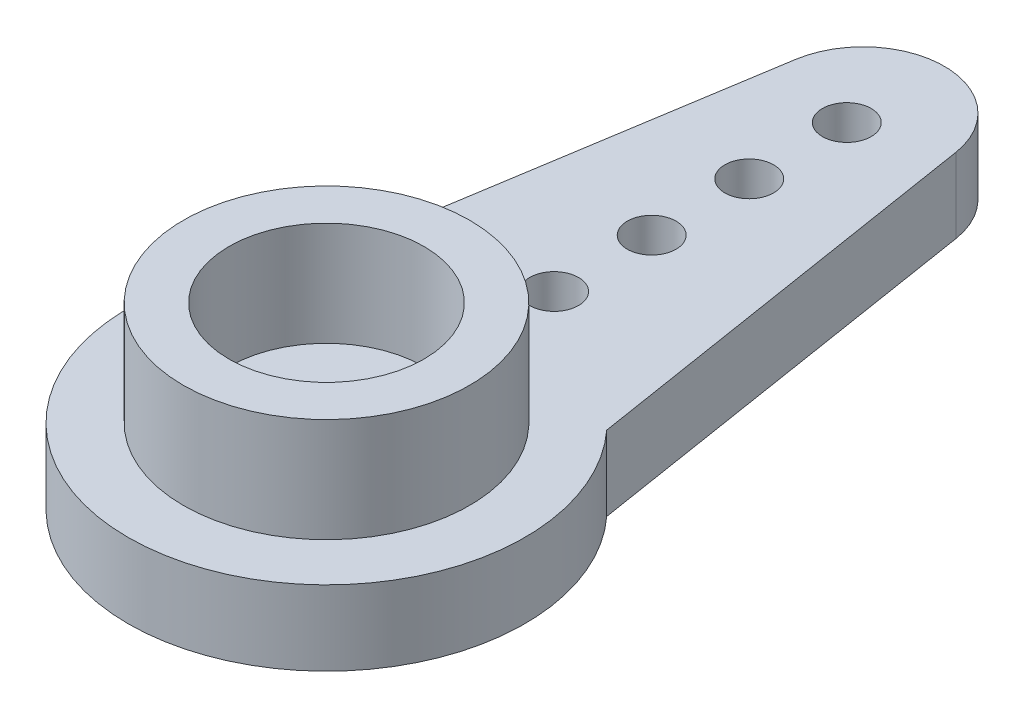
ISO-10303-21;
HEADER;
FILE_DESCRIPTION(('STEP AP214'),'2;1');
FILE_NAME('part.step','',(''),(''),'','','');
FILE_SCHEMA(('AUTOMOTIVE_DESIGN { 1 0 10303 214 1 1 1 1 }'));
ENDSEC;
DATA;
#1=APPLICATION_CONTEXT('core data for automotive mechanical design processes');
#2=APPLICATION_PROTOCOL_DEFINITION('international standard','automotive_design',2000,#1);
#3=PRODUCT_CONTEXT('',#1,'mechanical');
#4=PRODUCT('Part','Part','',(#3));
#5=PRODUCT_RELATED_PRODUCT_CATEGORY('part','',(#4));
#6=PRODUCT_DEFINITION_FORMATION('','',#4);
#7=PRODUCT_DEFINITION_CONTEXT('part definition',#1,'design');
#8=PRODUCT_DEFINITION('design','',#6,#7);
#9=PRODUCT_DEFINITION_SHAPE('','',#8);
#10=(LENGTH_UNIT() NAMED_UNIT(*) SI_UNIT(.MILLI.,.METRE.));
#11=(NAMED_UNIT(*) PLANE_ANGLE_UNIT() SI_UNIT($,.RADIAN.));
#12=(NAMED_UNIT(*) SI_UNIT($,.STERADIAN.) SOLID_ANGLE_UNIT());
#13=UNCERTAINTY_MEASURE_WITH_UNIT(LENGTH_MEASURE(1.E-05),#10,'distance_accuracy_value','');
#14=(GEOMETRIC_REPRESENTATION_CONTEXT(3) GLOBAL_UNCERTAINTY_ASSIGNED_CONTEXT((#13)) GLOBAL_UNIT_ASSIGNED_CONTEXT((#10,
#11,#12)) REPRESENTATION_CONTEXT('',''));
#15=CARTESIAN_POINT('',(0.,0.,0.));
#16=DIRECTION('',(0.,0.,1.));
#17=DIRECTION('',(1.,0.,0.));
#18=AXIS2_PLACEMENT_3D('',#15,#16,#17);
#19=CARTESIAN_POINT('',(0.,2.3,0.));
#20=DIRECTION('',(0.,1.,0.));
#21=DIRECTION('',(0.,0.,1.));
#22=AXIS2_PLACEMENT_3D('',#19,#20,#21);
#23=PLANE('',#22);
#24=CARTESIAN_POINT('',(0.,2.3,0.));
#25=DIRECTION('',(0.,1.,0.));
#26=DIRECTION('',(0.,0.,1.));
#27=AXIS2_PLACEMENT_3D('',#24,#25,#26);
#28=CIRCLE('',#27,1.5);
#29=CARTESIAN_POINT('',(0.,2.3,1.5));
#30=VERTEX_POINT('',#29);
#31=EDGE_CURVE('E138',#30,#30,#28,.T.);
#32=ORIENTED_EDGE('',*,*,#31,.F.);
#33=EDGE_LOOP('',(#32));
#34=FACE_BOUND('',#33,.T.);
#35=CARTESIAN_POINT('',(0.,2.3,0.));
#36=DIRECTION('',(0.,1.,0.));
#37=DIRECTION('',(0.,0.,1.));
#38=AXIS2_PLACEMENT_3D('',#35,#36,#37);
#39=CIRCLE('',#38,3.);
#40=CARTESIAN_POINT('',(0.,2.3,3.));
#41=VERTEX_POINT('',#40);
#42=EDGE_CURVE('E126',#41,#41,#39,.T.);
#43=ORIENTED_EDGE('',*,*,#42,.T.);
#44=EDGE_LOOP('',(#43));
#45=FACE_BOUND('',#44,.T.);
#46=ADVANCED_FACE('F37',(#34,#45),#23,.T.);
#47=CARTESIAN_POINT('',(0.,2.3,0.));
#48=DIRECTION('',(0.,1.,0.));
#49=DIRECTION('',(0.,0.,1.));
#50=AXIS2_PLACEMENT_3D('',#47,#48,#49);
#51=CIRCLE('',#50,4.4);
#52=CARTESIAN_POINT('',(0.,2.3,4.4));
#53=VERTEX_POINT('',#52);
#54=EDGE_CURVE('E11',#53,#53,#51,.T.);
#55=ORIENTED_EDGE('',*,*,#54,.F.);
#56=EDGE_LOOP('',(#55));
#57=FACE_BOUND('',#56,.T.);
#58=CARTESIAN_POINT('',(0.,2.3,0.));
#59=DIRECTION('',(0.,1.,0.));
#60=DIRECTION('',(0.,0.,1.));
#61=AXIS2_PLACEMENT_3D('',#58,#59,#60);
#62=CIRCLE('',#61,6.1);
#63=CARTESIAN_POINT('',(-4.5,2.3,-4.1182520563948));
#64=VERTEX_POINT('',#63);
#65=CARTESIAN_POINT('',(4.5,2.3,-4.1182520563948));
#66=VERTEX_POINT('',#65);
#67=EDGE_CURVE('E46',#64,#66,#62,.T.);
#68=ORIENTED_EDGE('',*,*,#67,.T.);
#69=DIRECTION('',(0.157019797021949,0.,0.987595455307074));
#70=VECTOR('',#69,1.);
#71=CARTESIAN_POINT('',(5.02767726414761,2.3,-0.799360567392308));
#72=LINE('',#71,#70);
#73=CARTESIAN_POINT('',(2.46898863826769,2.3,-16.8925494925549));
#74=VERTEX_POINT('',#73);
#75=EDGE_CURVE('E100',#74,#66,#72,.T.);
#76=ORIENTED_EDGE('',*,*,#75,.F.);
#77=CARTESIAN_POINT('',(0.,2.3,-16.5));
#78=DIRECTION('',(0.,-1.,0.));
#79=DIRECTION('',(0.,0.,-1.));
#80=AXIS2_PLACEMENT_3D('',#77,#78,#79);
#81=CIRCLE('',#80,2.5);
#82=CARTESIAN_POINT('',(-2.46898863826768,2.3,-16.8925494925549));
#83=VERTEX_POINT('',#82);
#84=EDGE_CURVE('E81',#83,#74,#81,.T.);
#85=ORIENTED_EDGE('',*,*,#84,.F.);
#86=DIRECTION('',(-0.15701979702195,0.,0.987595455307073));
#87=VECTOR('',#86,1.);
#88=CARTESIAN_POINT('',(-5.02767726414761,2.3,-0.799360567392309));
#89=LINE('',#88,#87);
#90=EDGE_CURVE('E92',#83,#64,#89,.T.);
#91=ORIENTED_EDGE('',*,*,#90,.T.);
#92=EDGE_LOOP('',(#68,#76,#85,#91));
#93=FACE_BOUND('',#92,.T.);
#94=CARTESIAN_POINT('',(0.,2.3,-7.));
#95=DIRECTION('',(0.,-1.,0.));
#96=DIRECTION('',(0.,0.,-1.));
#97=AXIS2_PLACEMENT_3D('',#94,#95,#96);
#98=CIRCLE('',#97,0.75);
#99=CARTESIAN_POINT('',(0.,2.3,-7.75));
#100=VERTEX_POINT('',#99);
#101=EDGE_CURVE('E123',#100,#100,#98,.T.);
#102=ORIENTED_EDGE('',*,*,#101,.T.);
#103=EDGE_LOOP('',(#102));
#104=FACE_BOUND('',#103,.T.);
#105=CARTESIAN_POINT('',(0.,2.3,-10.));
#106=DIRECTION('',(0.,-1.,0.));
#107=DIRECTION('',(0.,0.,-1.));
#108=AXIS2_PLACEMENT_3D('',#105,#106,#107);
#109=CIRCLE('',#108,0.750000000000001);
#110=CARTESIAN_POINT('',(0.,2.3,-10.75));
#111=VERTEX_POINT('',#110);
#112=EDGE_CURVE('E305',#111,#111,#109,.T.);
#113=ORIENTED_EDGE('',*,*,#112,.T.);
#114=EDGE_LOOP('',(#113));
#115=FACE_BOUND('',#114,.T.);
#116=CARTESIAN_POINT('',(0.,2.3,-13.));
#117=DIRECTION('',(0.,-1.,0.));
#118=DIRECTION('',(0.,0.,-1.));
#119=AXIS2_PLACEMENT_3D('',#116,#117,#118);
#120=CIRCLE('',#119,0.750000000000001);
#121=CARTESIAN_POINT('',(0.,2.3,-13.75));
#122=VERTEX_POINT('',#121);
#123=EDGE_CURVE('E303',#122,#122,#120,.T.);
#124=ORIENTED_EDGE('',*,*,#123,.T.);
#125=EDGE_LOOP('',(#124));
#126=FACE_BOUND('',#125,.T.);
#127=CARTESIAN_POINT('',(0.,2.3,-16.));
#128=DIRECTION('',(0.,-1.,0.));
#129=DIRECTION('',(0.,0.,-1.));
#130=AXIS2_PLACEMENT_3D('',#127,#128,#129);
#131=CIRCLE('',#130,0.75);
#132=CARTESIAN_POINT('',(0.,2.3,-16.75));
#133=VERTEX_POINT('',#132);
#134=EDGE_CURVE('E95',#133,#133,#131,.T.);
#135=ORIENTED_EDGE('',*,*,#134,.T.);
#136=EDGE_LOOP('',(#135));
#137=FACE_BOUND('',#136,.T.);
#138=ADVANCED_FACE('F97',(#57,#93,#104,#115,#126,#137),#23,.T.);
#139=CARTESIAN_POINT('',(0.,0.,0.));
#140=DIRECTION('',(0.,1.,0.));
#141=DIRECTION('',(0.,0.,1.));
#142=AXIS2_PLACEMENT_3D('',#139,#140,#141);
#143=PLANE('',#142);
#144=CARTESIAN_POINT('',(0.,0.,0.));
#145=DIRECTION('',(0.,1.,0.));
#146=DIRECTION('',(0.,0.,1.));
#147=AXIS2_PLACEMENT_3D('',#144,#145,#146);
#148=CIRCLE('',#147,6.1);
#149=CARTESIAN_POINT('',(-4.5,0.,-4.1182520563948));
#150=VERTEX_POINT('',#149);
#151=CARTESIAN_POINT('',(4.5,0.,-4.1182520563948));
#152=VERTEX_POINT('',#151);
#153=EDGE_CURVE('E41',#150,#152,#148,.T.);
#154=ORIENTED_EDGE('',*,*,#153,.F.);
#155=DIRECTION('',(-0.15701979702195,0.,0.987595455307073));
#156=VECTOR('',#155,1.);
#157=CARTESIAN_POINT('',(-5.02767726414761,0.,-0.799360567392309));
#158=LINE('',#157,#156);
#159=CARTESIAN_POINT('',(-2.46898863826768,0.,-16.8925494925549));
#160=VERTEX_POINT('',#159);
#161=EDGE_CURVE('E117',#160,#150,#158,.T.);
#162=ORIENTED_EDGE('',*,*,#161,.F.);
#163=CARTESIAN_POINT('',(0.,0.,-16.5));
#164=DIRECTION('',(0.,-1.,0.));
#165=DIRECTION('',(0.,0.,-1.));
#166=AXIS2_PLACEMENT_3D('',#163,#164,#165);
#167=CIRCLE('',#166,2.5);
#168=CARTESIAN_POINT('',(2.46898863826769,0.,-16.8925494925549));
#169=VERTEX_POINT('',#168);
#170=EDGE_CURVE('E84',#160,#169,#167,.T.);
#171=ORIENTED_EDGE('',*,*,#170,.T.);
#172=DIRECTION('',(0.157019797021949,0.,0.987595455307074));
#173=VECTOR('',#172,1.);
#174=CARTESIAN_POINT('',(5.02767726414761,0.,-0.799360567392308));
#175=LINE('',#174,#173);
#176=EDGE_CURVE('E120',#169,#152,#175,.T.);
#177=ORIENTED_EDGE('',*,*,#176,.T.);
#178=EDGE_LOOP('',(#154,#162,#171,#177));
#179=FACE_BOUND('',#178,.T.);
#180=CARTESIAN_POINT('',(0.,0.,0.));
#181=DIRECTION('',(0.,1.,0.));
#182=DIRECTION('',(0.,0.,1.));
#183=AXIS2_PLACEMENT_3D('',#180,#181,#182);
#184=CIRCLE('',#183,1.5);
#185=CARTESIAN_POINT('',(0.,0.,1.5));
#186=VERTEX_POINT('',#185);
#187=EDGE_CURVE('E136',#186,#186,#184,.T.);
#188=ORIENTED_EDGE('',*,*,#187,.T.);
#189=EDGE_LOOP('',(#188));
#190=FACE_BOUND('',#189,.T.);
#191=CARTESIAN_POINT('',(0.,0.,-7.));
#192=DIRECTION('',(0.,-1.,0.));
#193=DIRECTION('',(0.,0.,-1.));
#194=AXIS2_PLACEMENT_3D('',#191,#192,#193);
#195=CIRCLE('',#194,0.75);
#196=CARTESIAN_POINT('',(0.,0.,-7.75));
#197=VERTEX_POINT('',#196);
#198=EDGE_CURVE('E105',#197,#197,#195,.T.);
#199=ORIENTED_EDGE('',*,*,#198,.F.);
#200=EDGE_LOOP('',(#199));
#201=FACE_BOUND('',#200,.T.);
#202=CARTESIAN_POINT('',(0.,0.,-10.));
#203=DIRECTION('',(0.,-1.,0.));
#204=DIRECTION('',(0.,0.,-1.));
#205=AXIS2_PLACEMENT_3D('',#202,#203,#204);
#206=CIRCLE('',#205,0.750000000000001);
#207=CARTESIAN_POINT('',(0.,0.,-10.75));
#208=VERTEX_POINT('',#207);
#209=EDGE_CURVE('E108',#208,#208,#206,.T.);
#210=ORIENTED_EDGE('',*,*,#209,.F.);
#211=EDGE_LOOP('',(#210));
#212=FACE_BOUND('',#211,.T.);
#213=CARTESIAN_POINT('',(0.,0.,-13.));
#214=DIRECTION('',(0.,-1.,0.));
#215=DIRECTION('',(0.,0.,-1.));
#216=AXIS2_PLACEMENT_3D('',#213,#214,#215);
#217=CIRCLE('',#216,0.750000000000001);
#218=CARTESIAN_POINT('',(0.,0.,-13.75));
#219=VERTEX_POINT('',#218);
#220=EDGE_CURVE('E111',#219,#219,#217,.T.);
#221=ORIENTED_EDGE('',*,*,#220,.F.);
#222=EDGE_LOOP('',(#221));
#223=FACE_BOUND('',#222,.T.);
#224=CARTESIAN_POINT('',(0.,0.,-16.));
#225=DIRECTION('',(0.,-1.,0.));
#226=DIRECTION('',(0.,0.,-1.));
#227=AXIS2_PLACEMENT_3D('',#224,#225,#226);
#228=CIRCLE('',#227,0.75);
#229=CARTESIAN_POINT('',(0.,0.,-16.75));
#230=VERTEX_POINT('',#229);
#231=EDGE_CURVE('E114',#230,#230,#228,.T.);
#232=ORIENTED_EDGE('',*,*,#231,.F.);
#233=EDGE_LOOP('',(#232));
#234=FACE_BOUND('',#233,.T.);
#235=ADVANCED_FACE('F146',(#179,#190,#201,#212,#223,#234),#143,.F.);
#236=CARTESIAN_POINT('',(0.,2.3,0.));
#237=DIRECTION('',(0.,-1.,0.));
#238=DIRECTION('',(0.,0.,-1.));
#239=AXIS2_PLACEMENT_3D('',#236,#237,#238);
#240=CYLINDRICAL_SURFACE('',#239,6.1);
#241=ORIENTED_EDGE('',*,*,#153,.T.);
#242=DIRECTION('',(0.,-1.,0.));
#243=VECTOR('',#242,1.);
#244=CARTESIAN_POINT('',(4.5,2.3,-4.1182520563948));
#245=LINE('',#244,#243);
#246=EDGE_CURVE('E124',#66,#152,#245,.T.);
#247=ORIENTED_EDGE('',*,*,#246,.F.);
#248=ORIENTED_EDGE('',*,*,#67,.F.);
#249=DIRECTION('',(0.,-1.,0.));
#250=VECTOR('',#249,1.);
#251=CARTESIAN_POINT('',(-4.5,2.3,-4.1182520563948));
#252=LINE('',#251,#250);
#253=EDGE_CURVE('E89',#64,#150,#252,.T.);
#254=ORIENTED_EDGE('',*,*,#253,.T.);
#255=EDGE_LOOP('',(#241,#247,#248,#254));
#256=FACE_BOUND('',#255,.T.);
#257=ADVANCED_FACE('F39',(#256),#240,.T.);
#258=CARTESIAN_POINT('',(0.,2.3,0.));
#259=DIRECTION('',(0.,-1.,0.));
#260=DIRECTION('',(0.,0.,-1.));
#261=AXIS2_PLACEMENT_3D('',#258,#259,#260);
#262=CYLINDRICAL_SURFACE('',#261,1.5);
#263=ORIENTED_EDGE('',*,*,#31,.T.);
#264=EDGE_LOOP('',(#263));
#265=FACE_BOUND('',#264,.T.);
#266=ORIENTED_EDGE('',*,*,#187,.F.);
#267=EDGE_LOOP('',(#266));
#268=FACE_BOUND('',#267,.T.);
#269=ADVANCED_FACE('F149',(#265,#268),#262,.F.);
#270=CARTESIAN_POINT('',(0.,5.5,0.));
#271=DIRECTION('',(0.,1.,0.));
#272=DIRECTION('',(0.,0.,1.));
#273=AXIS2_PLACEMENT_3D('',#270,#271,#272);
#274=PLANE('',#273);
#275=CARTESIAN_POINT('',(0.,5.5,0.));
#276=DIRECTION('',(0.,1.,0.));
#277=DIRECTION('',(0.,0.,1.));
#278=AXIS2_PLACEMENT_3D('',#275,#276,#277);
#279=CIRCLE('',#278,4.4);
#280=CARTESIAN_POINT('',(0.,5.5,4.4));
#281=VERTEX_POINT('',#280);
#282=EDGE_CURVE('E132',#281,#281,#279,.T.);
#283=ORIENTED_EDGE('',*,*,#282,.T.);
#284=EDGE_LOOP('',(#283));
#285=FACE_BOUND('',#284,.T.);
#286=CARTESIAN_POINT('',(0.,5.5,0.));
#287=DIRECTION('',(0.,1.,0.));
#288=DIRECTION('',(0.,0.,1.));
#289=AXIS2_PLACEMENT_3D('',#286,#287,#288);
#290=CIRCLE('',#289,3.);
#291=CARTESIAN_POINT('',(0.,5.5,3.));
#292=VERTEX_POINT('',#291);
#293=EDGE_CURVE('E129',#292,#292,#290,.T.);
#294=ORIENTED_EDGE('',*,*,#293,.F.);
#295=EDGE_LOOP('',(#294));
#296=FACE_BOUND('',#295,.T.);
#297=ADVANCED_FACE('F154',(#285,#296),#274,.T.);
#298=CARTESIAN_POINT('',(0.,5.5,0.));
#299=DIRECTION('',(0.,-1.,0.));
#300=DIRECTION('',(0.,0.,-1.));
#301=AXIS2_PLACEMENT_3D('',#298,#299,#300);
#302=CYLINDRICAL_SURFACE('',#301,4.4);
#303=ORIENTED_EDGE('',*,*,#282,.F.);
#304=EDGE_LOOP('',(#303));
#305=FACE_BOUND('',#304,.T.);
#306=ORIENTED_EDGE('',*,*,#54,.T.);
#307=EDGE_LOOP('',(#306));
#308=FACE_BOUND('',#307,.T.);
#309=ADVANCED_FACE('F167',(#305,#308),#302,.T.);
#310=CARTESIAN_POINT('',(0.,5.5,0.));
#311=DIRECTION('',(0.,-1.,0.));
#312=DIRECTION('',(0.,0.,-1.));
#313=AXIS2_PLACEMENT_3D('',#310,#311,#312);
#314=CYLINDRICAL_SURFACE('',#313,3.);
#315=ORIENTED_EDGE('',*,*,#293,.T.);
#316=EDGE_LOOP('',(#315));
#317=FACE_BOUND('',#316,.T.);
#318=ORIENTED_EDGE('',*,*,#42,.F.);
#319=EDGE_LOOP('',(#318));
#320=FACE_BOUND('',#319,.T.);
#321=ADVANCED_FACE('F170',(#317,#320),#314,.F.);
#322=CARTESIAN_POINT('',(5.02767726414761,2.3,-0.799360567392308));
#323=DIRECTION('',(0.987595455307073,0.,-0.157019797021949));
#324=DIRECTION('',(-0.157019797021949,0.,-0.987595455307074));
#325=AXIS2_PLACEMENT_3D('',#322,#323,#324);
#326=PLANE('',#325);
#327=ORIENTED_EDGE('',*,*,#176,.F.);
#328=DIRECTION('',(0.,-1.,0.));
#329=VECTOR('',#328,1.);
#330=CARTESIAN_POINT('',(2.46898863826769,2.3,-16.8925494925549));
#331=LINE('',#330,#329);
#332=EDGE_CURVE('E88',#74,#169,#331,.T.);
#333=ORIENTED_EDGE('',*,*,#332,.F.);
#334=ORIENTED_EDGE('',*,*,#75,.T.);
#335=ORIENTED_EDGE('',*,*,#246,.T.);
#336=EDGE_LOOP('',(#327,#333,#334,#335));
#337=FACE_BOUND('',#336,.T.);
#338=ADVANCED_FACE('F144',(#337),#326,.T.);
#339=CARTESIAN_POINT('',(0.,2.3,-16.5));
#340=DIRECTION('',(0.,-1.,0.));
#341=DIRECTION('',(0.,0.,-1.));
#342=AXIS2_PLACEMENT_3D('',#339,#340,#341);
#343=CYLINDRICAL_SURFACE('',#342,2.5);
#344=ORIENTED_EDGE('',*,*,#170,.F.);
#345=DIRECTION('',(0.,-1.,0.));
#346=VECTOR('',#345,1.);
#347=CARTESIAN_POINT('',(-2.46898863826768,2.3,-16.8925494925549));
#348=LINE('',#347,#346);
#349=EDGE_CURVE('E77',#83,#160,#348,.T.);
#350=ORIENTED_EDGE('',*,*,#349,.F.);
#351=ORIENTED_EDGE('',*,*,#84,.T.);
#352=ORIENTED_EDGE('',*,*,#332,.T.);
#353=EDGE_LOOP('',(#344,#350,#351,#352));
#354=FACE_BOUND('',#353,.T.);
#355=ADVANCED_FACE('F79',(#354),#343,.T.);
#356=CARTESIAN_POINT('',(0.,2.3,-16.));
#357=DIRECTION('',(0.,-1.,0.));
#358=DIRECTION('',(0.,0.,-1.));
#359=AXIS2_PLACEMENT_3D('',#356,#357,#358);
#360=CYLINDRICAL_SURFACE('',#359,0.75);
#361=ORIENTED_EDGE('',*,*,#134,.F.);
#362=EDGE_LOOP('',(#361));
#363=FACE_BOUND('',#362,.T.);
#364=ORIENTED_EDGE('',*,*,#231,.T.);
#365=EDGE_LOOP('',(#364));
#366=FACE_BOUND('',#365,.T.);
#367=ADVANCED_FACE('F189',(#363,#366),#360,.F.);
#368=CARTESIAN_POINT('',(0.,2.3,-13.));
#369=DIRECTION('',(0.,-1.,0.));
#370=DIRECTION('',(0.,0.,-1.));
#371=AXIS2_PLACEMENT_3D('',#368,#369,#370);
#372=CYLINDRICAL_SURFACE('',#371,0.750000000000001);
#373=ORIENTED_EDGE('',*,*,#123,.F.);
#374=EDGE_LOOP('',(#373));
#375=FACE_BOUND('',#374,.T.);
#376=ORIENTED_EDGE('',*,*,#220,.T.);
#377=EDGE_LOOP('',(#376));
#378=FACE_BOUND('',#377,.T.);
#379=ADVANCED_FACE('F185',(#375,#378),#372,.F.);
#380=CARTESIAN_POINT('',(0.,2.3,-10.));
#381=DIRECTION('',(0.,-1.,0.));
#382=DIRECTION('',(0.,0.,-1.));
#383=AXIS2_PLACEMENT_3D('',#380,#381,#382);
#384=CYLINDRICAL_SURFACE('',#383,0.750000000000001);
#385=ORIENTED_EDGE('',*,*,#112,.F.);
#386=EDGE_LOOP('',(#385));
#387=FACE_BOUND('',#386,.T.);
#388=ORIENTED_EDGE('',*,*,#209,.T.);
#389=EDGE_LOOP('',(#388));
#390=FACE_BOUND('',#389,.T.);
#391=ADVANCED_FACE('F181',(#387,#390),#384,.F.);
#392=CARTESIAN_POINT('',(0.,2.3,-7.));
#393=DIRECTION('',(0.,-1.,0.));
#394=DIRECTION('',(0.,0.,-1.));
#395=AXIS2_PLACEMENT_3D('',#392,#393,#394);
#396=CYLINDRICAL_SURFACE('',#395,0.75);
#397=ORIENTED_EDGE('',*,*,#101,.F.);
#398=EDGE_LOOP('',(#397));
#399=FACE_BOUND('',#398,.T.);
#400=ORIENTED_EDGE('',*,*,#198,.T.);
#401=EDGE_LOOP('',(#400));
#402=FACE_BOUND('',#401,.T.);
#403=ADVANCED_FACE('F178',(#399,#402),#396,.F.);
#404=CARTESIAN_POINT('',(-5.02767726414761,2.3,-0.799360567392309));
#405=DIRECTION('',(0.987595455307073,0.,0.15701979702195));
#406=DIRECTION('',(0.15701979702195,0.,-0.987595455307073));
#407=AXIS2_PLACEMENT_3D('',#404,#405,#406);
#408=PLANE('',#407);
#409=ORIENTED_EDGE('',*,*,#161,.T.);
#410=ORIENTED_EDGE('',*,*,#253,.F.);
#411=ORIENTED_EDGE('',*,*,#90,.F.);
#412=ORIENTED_EDGE('',*,*,#349,.T.);
#413=EDGE_LOOP('',(#409,#410,#411,#412));
#414=FACE_BOUND('',#413,.T.);
#415=ADVANCED_FACE('F93',(#414),#408,.F.);
#416=CLOSED_SHELL('',(#46,#138,#235,#257,#269,#297,#309,#321,#338,#355,#367,#379,#391,#403,#415));
#417=MANIFOLD_SOLID_BREP('B2',#416);
#418=ADVANCED_BREP_SHAPE_REPRESENTATION('',(#18,#417),#14);
#419=SHAPE_DEFINITION_REPRESENTATION(#9,#418);
ENDSEC;
END-ISO-10303-21;
